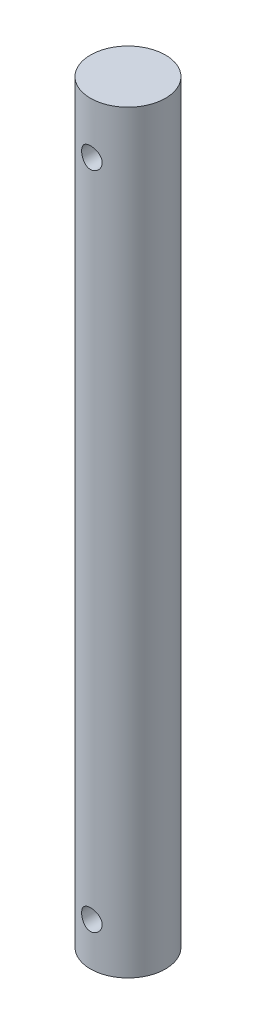
ISO-10303-21;
HEADER;
FILE_DESCRIPTION(('STEP AP214'),'2;1');
FILE_NAME('part.step','',(''),(''),'','','');
FILE_SCHEMA(('AUTOMOTIVE_DESIGN { 1 0 10303 214 1 1 1 1 }'));
ENDSEC;
DATA;
#1=APPLICATION_CONTEXT('core data for automotive mechanical design processes');
#2=APPLICATION_PROTOCOL_DEFINITION('international standard','automotive_design',2000,#1);
#3=PRODUCT_CONTEXT('',#1,'mechanical');
#4=PRODUCT('Part','Part','',(#3));
#5=PRODUCT_RELATED_PRODUCT_CATEGORY('part','',(#4));
#6=PRODUCT_DEFINITION_FORMATION('','',#4);
#7=PRODUCT_DEFINITION_CONTEXT('part definition',#1,'design');
#8=PRODUCT_DEFINITION('design','',#6,#7);
#9=PRODUCT_DEFINITION_SHAPE('','',#8);
#10=(LENGTH_UNIT() NAMED_UNIT(*) SI_UNIT(.MILLI.,.METRE.));
#11=(NAMED_UNIT(*) PLANE_ANGLE_UNIT() SI_UNIT($,.RADIAN.));
#12=(NAMED_UNIT(*) SI_UNIT($,.STERADIAN.) SOLID_ANGLE_UNIT());
#13=UNCERTAINTY_MEASURE_WITH_UNIT(LENGTH_MEASURE(1.E-05),#10,'distance_accuracy_value','');
#14=(GEOMETRIC_REPRESENTATION_CONTEXT(3) GLOBAL_UNCERTAINTY_ASSIGNED_CONTEXT((#13)) GLOBAL_UNIT_ASSIGNED_CONTEXT((#10,
#11,#12)) REPRESENTATION_CONTEXT('',''));
#15=CARTESIAN_POINT('',(0.,0.,0.));
#16=DIRECTION('',(0.,0.,1.));
#17=DIRECTION('',(1.,0.,0.));
#18=AXIS2_PLACEMENT_3D('',#15,#16,#17);
#19=CARTESIAN_POINT('',(0.,111.76,0.));
#20=DIRECTION('',(0.,-1.,0.));
#21=DIRECTION('',(0.,0.,-1.));
#22=AXIS2_PLACEMENT_3D('',#19,#20,#21);
#23=CYLINDRICAL_SURFACE('',#22,5.55625);
#24=CARTESIAN_POINT('',(0.,105.664,-5.55625));
#25=CARTESIAN_POINT('',(-0.0839243274042606,105.663998199307,-5.55624882927294));
#26=CARTESIAN_POINT('',(-0.167867613481108,105.65704443173,-5.55432995065547));
#27=CARTESIAN_POINT('',(-0.333330188617833,105.629465965434,-5.54686174318601));
#28=CARTESIAN_POINT('',(-0.414848392822721,105.608835241665,-5.5413108143368));
#29=CARTESIAN_POINT('',(-0.573048949549514,105.554628448365,-5.52719021743517));
#30=CARTESIAN_POINT('',(-0.649737580305421,105.521069606601,-5.51862456804953));
#31=CARTESIAN_POINT('',(-0.796398529338004,105.44202456858,-5.49937645772791));
#32=CARTESIAN_POINT('',(-0.866370297474205,105.396537396477,-5.48869382362082));
#33=CARTESIAN_POINT('',(-0.99931928369471,105.293755055338,-5.46607048298212));
#34=CARTESIAN_POINT('',(-1.06210920833413,105.236222567386,-5.45410730472241));
#35=CARTESIAN_POINT('',(-1.17728133710283,105.111489691459,-5.43041318256194));
#36=CARTESIAN_POINT('',(-1.22966211746745,105.044287983091,-5.41868227062791));
#37=CARTESIAN_POINT('',(-1.32345791673896,104.900609739913,-5.39654936725636));
#38=CARTESIAN_POINT('',(-1.36465461047249,104.823985922807,-5.38617563863397));
#39=CARTESIAN_POINT('',(-1.43350548692101,104.664568614997,-5.36826327411803));
#40=CARTESIAN_POINT('',(-1.46116232846057,104.581776339277,-5.36072408167333));
#41=CARTESIAN_POINT('',(-1.50149248412255,104.414453214906,-5.34956689273426));
#42=CARTESIAN_POINT('',(-1.51450666910971,104.330010611584,-5.34585986082083));
#43=CARTESIAN_POINT('',(-1.5262452131801,104.160065544931,-5.34252094447796));
#44=CARTESIAN_POINT('',(-1.52497241089828,104.074563295508,-5.3428882505314));
#45=CARTESIAN_POINT('',(-1.50844309109985,103.907610283374,-5.34757698918831));
#46=CARTESIAN_POINT('',(-1.49360213219395,103.826114548185,-5.35178090922778));
#47=CARTESIAN_POINT('',(-1.45102462477444,103.666816673094,-5.36348061470836));
#48=CARTESIAN_POINT('',(-1.42328699250619,103.58901484421,-5.37097667679728));
#49=CARTESIAN_POINT('',(-1.35537214758625,103.438244815396,-5.38851725394586));
#50=CARTESIAN_POINT('',(-1.31505166939105,103.365344678303,-5.39859086555452));
#51=CARTESIAN_POINT('',(-1.22321553044335,103.227200544977,-5.42013622554189));
#52=CARTESIAN_POINT('',(-1.17169755151803,103.161958138406,-5.43160826321474));
#53=CARTESIAN_POINT('',(-1.05681733719701,103.038610809698,-5.45514428743246));
#54=CARTESIAN_POINT('',(-0.993106997980926,102.98083090482,-5.46721502232855));
#55=CARTESIAN_POINT('',(-0.856752537903141,102.876706774006,-5.49023340090312));
#56=CARTESIAN_POINT('',(-0.784108023579616,102.830363051991,-5.50118099507941));
#57=CARTESIAN_POINT('',(-0.631424988575477,102.750272126302,-5.52079353773937));
#58=CARTESIAN_POINT('',(-0.551352559274145,102.716586631162,-5.52944724479469));
#59=CARTESIAN_POINT('',(-0.386388936646239,102.663250461562,-5.54341585122075));
#60=CARTESIAN_POINT('',(-0.301498864363417,102.643596536356,-5.54873152389172));
#61=CARTESIAN_POINT('',(-0.132081052810915,102.619398428831,-5.55530699804715));
#62=CARTESIAN_POINT('',(-0.0476208856908242,102.614412682289,-5.55668529048076));
#63=CARTESIAN_POINT('',(0.120929807927627,102.618469039359,-5.55557289822189));
#64=CARTESIAN_POINT('',(0.205020374006141,102.627509602299,-5.55308263845726));
#65=CARTESIAN_POINT('',(0.368848997837754,102.659000757044,-5.54458974100724));
#66=CARTESIAN_POINT('',(0.448638585108349,102.681202488859,-5.5386523262704));
#67=CARTESIAN_POINT('',(0.603351080798779,102.738094495566,-5.52394113073766));
#68=CARTESIAN_POINT('',(0.678273445806869,102.772786162106,-5.5151670338855));
#69=CARTESIAN_POINT('',(0.822820693886013,102.854475022256,-5.49548122212863));
#70=CARTESIAN_POINT('',(0.892306156232276,102.901709036011,-5.48452951452932));
#71=CARTESIAN_POINT('',(1.02251874875153,103.006846344263,-5.46175304336441));
#72=CARTESIAN_POINT('',(1.08324404065646,103.064751872323,-5.4499280973399));
#73=CARTESIAN_POINT('',(1.19609216047285,103.191653144048,-5.4262976262354));
#74=CARTESIAN_POINT('',(1.24790272921414,103.260929188316,-5.41450329841938));
#75=CARTESIAN_POINT('',(1.33917340547728,103.407443971058,-5.39265605664099));
#76=CARTESIAN_POINT('',(1.37863400084672,103.484682394842,-5.38260307389916));
#77=CARTESIAN_POINT('',(1.44378953392984,103.644565825087,-5.36549357581121));
#78=CARTESIAN_POINT('',(1.46956208430331,103.727177301195,-5.35842021405634));
#79=CARTESIAN_POINT('',(1.50678006719011,103.895790431922,-5.34807518269966));
#80=CARTESIAN_POINT('',(1.5182294227727,103.98179115158,-5.34480247213138));
#81=CARTESIAN_POINT('',(1.52624090954879,104.151534821032,-5.34251977468923));
#82=CARTESIAN_POINT('',(1.52330637763806,104.235252421502,-5.34336565837555));
#83=CARTESIAN_POINT('',(1.50380839065478,104.400950020403,-5.3488853889634));
#84=CARTESIAN_POINT('',(1.48724532571573,104.482930068505,-5.3535591262879));
#85=CARTESIAN_POINT('',(1.44125991905776,104.642150700005,-5.36611966754493));
#86=CARTESIAN_POINT('',(1.41195006317309,104.719426149309,-5.37397832529271));
#87=CARTESIAN_POINT('',(1.34139014616994,104.868022393666,-5.39202250814459));
#88=CARTESIAN_POINT('',(1.30013811478295,104.93934220363,-5.40220841714954));
#89=CARTESIAN_POINT('',(1.2053641066089,105.076390803484,-5.42415369878218));
#90=CARTESIAN_POINT('',(1.15150145907919,105.141877789456,-5.43595205485115));
#91=CARTESIAN_POINT('',(1.03367543481417,105.263047137032,-5.45958180950221));
#92=CARTESIAN_POINT('',(0.969709573359407,105.31872707961,-5.47141321550743));
#93=CARTESIAN_POINT('',(0.831715889749732,105.419966485837,-5.49410203830745));
#94=CARTESIAN_POINT('',(0.757490272137247,105.465263352594,-5.50493075009454));
#95=CARTESIAN_POINT('',(0.602181813240706,105.542665501018,-5.52407410513523));
#96=CARTESIAN_POINT('',(0.521103155250167,105.574778761207,-5.5323902681384));
#97=CARTESIAN_POINT('',(0.367006263526612,105.620994877289,-5.54457111499069));
#98=CARTESIAN_POINT('',(0.294615536455409,105.63708303896,-5.54891787666377));
#99=CARTESIAN_POINT('',(0.14815467190509,105.658585799439,-5.55475767664331));
#100=CARTESIAN_POINT('',(0.0740847228064985,105.664001589573,-5.55625103346661));
#101=CARTESIAN_POINT('',(0.,105.664,-5.55625));
#102=B_SPLINE_CURVE_WITH_KNOTS('',3,(#24,#25,#26,#27,#28,#29,#30,#31,#32,#33,#34,#35,#36,#37,
#38,#39,#40,#41,#42,#43,#44,#45,#46,#47,#48,#49,#50,#51,#52,#53,#54,#55,#56,#57,#58,#59,#60,#61,
#62,#63,#64,#65,#66,#67,#68,#69,#70,#71,#72,#73,#74,#75,#76,#77,#78,#79,#80,#81,#82,#83,#84,#85,
#86,#87,#88,#89,#90,#91,#92,#93,#94,#95,#96,#97,#98,#99,#100,#101),.UNSPECIFIED.,.T.,.F.,(4,2,2,
2,2,2,2,2,2,2,2,2,2,2,2,2,2,2,2,2,2,2,2,2,2,2,2,2,2,2,2,2,2,2,2,2,2,2,4),(0.,0.251501199213716,
0.503113264841162,0.754391190344406,1.00568967908189,1.26250543026143,1.5193562846045,
1.78090970140115,2.04241173625782,2.2976913839688,2.55292031189629,2.80058492434025,
3.04827035271029,3.29888562977404,3.54955284019771,3.80889216152386,4.06824290826825,
4.32884206806183,4.58938083428702,4.8419918929869,5.09457520645361,5.34252836207593,
5.5905091535655,5.84355386965232,6.0966516086208,6.35733261546725,6.61800332361465,
6.8771797807112,7.13628523479639,7.38638986963814,7.63648734517623,7.88442121500447,
8.13239601330179,8.38805664239398,8.64378024520016,8.90539297476192,9.16684714600983,
9.38888618327888,9.61090043356293),.UNSPECIFIED.);
#103=CARTESIAN_POINT('',(0.,105.664,-5.55625));
#104=VERTEX_POINT('',#103);
#105=EDGE_CURVE('E10',#104,#104,#102,.T.);
#106=ORIENTED_EDGE('',*,*,#105,.T.);
#107=EDGE_LOOP('',(#106));
#108=FACE_BOUND('',#107,.T.);
#109=CARTESIAN_POINT('',(1.524,104.14,5.34315806078203));
#110=CARTESIAN_POINT('',(1.52399816833775,104.056142663534,5.34315941810247));
#111=CARTESIAN_POINT('',(1.51705511226946,103.972266312316,5.34515377744604));
#112=CARTESIAN_POINT('',(1.48952304253656,103.806942508978,5.35289015791346));
#113=CARTESIAN_POINT('',(1.46892769632138,103.725496202351,5.35863391816043));
#114=CARTESIAN_POINT('',(1.41482426278523,103.567448251648,5.37317072542769));
#115=CARTESIAN_POINT('',(1.38133504918774,103.490839716064,5.38195931362969));
#116=CARTESIAN_POINT('',(1.30245434054345,103.344314786264,5.40158976640219));
#117=CARTESIAN_POINT('',(1.25706172631206,103.274399022162,5.41243182401788));
#118=CARTESIAN_POINT('',(1.15437813864968,103.141394526199,5.43526909544026));
#119=CARTESIAN_POINT('',(1.09682853873585,103.078509089796,5.44728568862049));
#120=CARTESIAN_POINT('',(0.972020397107993,102.963150435461,5.47093396159151));
#121=CARTESIAN_POINT('',(0.904760800373784,102.910678350444,5.48256559938672));
#122=CARTESIAN_POINT('',(0.761024229955041,102.816780513865,5.50437290503279));
#123=CARTESIAN_POINT('',(0.684409841659558,102.775558005564,5.5145204178342));
#124=CARTESIAN_POINT('',(0.525012541295411,102.70665688816,5.53197014500868));
#125=CARTESIAN_POINT('',(0.442230735174049,102.678975857491,5.53927286805626));
#126=CARTESIAN_POINT('',(0.274971592318378,102.638604649509,5.55005900415462));
#127=CARTESIAN_POINT('',(0.19058356734784,102.625568384738,5.55363044585493));
#128=CARTESIAN_POINT('',(0.0207477400907249,102.613766707802,5.55685988222459));
#129=CARTESIAN_POINT('',(-0.064699872273332,102.614998774057,5.55651856837839));
#130=CARTESIAN_POINT('',(-0.231816279019823,102.631457559312,5.55202495351416));
#131=CARTESIAN_POINT('',(-0.313525077460526,102.646310181193,5.5479745297692));
#132=CARTESIAN_POINT('',(-0.473242734899581,102.68898263309,5.53663879955745));
#133=CARTESIAN_POINT('',(-0.551251376716399,102.716803223228,5.52935330346678));
#134=CARTESIAN_POINT('',(-0.702294851027764,102.784901146699,5.51221718419817));
#135=CARTESIAN_POINT('',(-0.775269906878719,102.825304321132,5.5023408139316));
#136=CARTESIAN_POINT('',(-0.91353013480948,102.917323333223,5.48108354612888));
#137=CARTESIAN_POINT('',(-0.978813729397899,102.968941464876,5.46970234096875));
#138=CARTESIAN_POINT('',(-1.10207116119661,103.083901327657,5.44622999085762));
#139=CARTESIAN_POINT('',(-1.15973930813281,103.147568950491,5.4341277921692));
#140=CARTESIAN_POINT('',(-1.26365720776398,103.283795518428,5.41090819574316));
#141=CARTESIAN_POINT('',(-1.30990617823429,103.356355072127,5.39979086550342));
#142=CARTESIAN_POINT('',(-1.38992383136705,103.508999307096,5.3797533900604));
#143=CARTESIAN_POINT('',(-1.42360483707505,103.589132139214,5.37084882024921));
#144=CARTESIAN_POINT('',(-1.47691439394927,103.754229086825,5.35643622584647));
#145=CARTESIAN_POINT('',(-1.49654666394411,103.839191917341,5.35092730244986));
#146=CARTESIAN_POINT('',(-1.52066487732922,104.008666937251,5.34412252677493));
#147=CARTESIAN_POINT('',(-1.52560873389226,104.093108917344,5.34269935004931));
#148=CARTESIAN_POINT('',(-1.52147519923593,104.261613936199,5.34387801574711));
#149=CARTESIAN_POINT('',(-1.51239939934314,104.345677016882,5.34647940135533));
#150=CARTESIAN_POINT('',(-1.48088883607338,104.509242481336,5.35529064753445));
#151=CARTESIAN_POINT('',(-1.45873355718454,104.588803177399,5.36142495097166));
#152=CARTESIAN_POINT('',(-1.40200931185635,104.743078107674,5.37653605167272));
#153=CARTESIAN_POINT('',(-1.36743865594816,104.817791680662,5.3855132357725));
#154=CARTESIAN_POINT('',(-1.28594890708856,104.962155664807,5.40555674374057));
#155=CARTESIAN_POINT('',(-1.23876324244313,105.031649431092,5.41666650060783));
#156=CARTESIAN_POINT('',(-1.13371024147767,105.161900560189,5.43962318863844));
#157=CARTESIAN_POINT('',(-1.07584077660519,105.222656177786,5.4514702663872));
#158=CARTESIAN_POINT('',(-0.94893709602466,105.335629378083,5.4750083131647));
#159=CARTESIAN_POINT('',(-0.879613955130439,105.387526437876,5.48668324147607));
#160=CARTESIAN_POINT('',(-0.732976059744222,105.47894943561,5.50818873122632));
#161=CARTESIAN_POINT('',(-0.655661730321704,105.518476031115,5.51801939068783));
#162=CARTESIAN_POINT('',(-0.495779467362986,105.583666353693,5.5346653466112));
#163=CARTESIAN_POINT('',(-0.413256599149013,105.609434540148,5.54150329121973));
#164=CARTESIAN_POINT('',(-0.244835095855061,105.646673543044,5.55149321901716));
#165=CARTESIAN_POINT('',(-0.158937260620097,105.658147726238,5.55464607016752));
#166=CARTESIAN_POINT('',(0.0108088965678619,105.666251999092,5.5568669589549));
#167=CARTESIAN_POINT('',(0.0946334508767148,105.663350991294,5.55606403455116));
#168=CARTESIAN_POINT('',(0.26055415651223,105.643883020738,5.55075810383556));
#169=CARTESIAN_POINT('',(0.342650379415667,105.627316625061,5.54625525106217));
#170=CARTESIAN_POINT('',(0.502185417404082,105.58125928302,5.53408359766452));
#171=CARTESIAN_POINT('',(0.579655097689046,105.551868335959,5.52643931859486));
#172=CARTESIAN_POINT('',(0.72860741827618,105.481085203441,5.50878181387809));
#173=CARTESIAN_POINT('',(0.800089180653257,105.439691262107,5.49876824167477));
#174=CARTESIAN_POINT('',(0.937199610397853,105.344732208982,5.47709107884905));
#175=CARTESIAN_POINT('',(1.00260936098065,105.290859769732,5.46538925033646));
#176=CARTESIAN_POINT('',(1.1236185633773,105.173049297683,5.44180154601972));
#177=CARTESIAN_POINT('',(1.17921537880202,105.109108568595,5.42991562168566));
#178=CARTESIAN_POINT('',(1.2803264223329,104.971158656882,5.40698025075123));
#179=CARTESIAN_POINT('',(1.32557120376756,104.896947175936,5.39595722357438));
#180=CARTESIAN_POINT('',(1.40287948777494,104.741677435336,5.37637832131599));
#181=CARTESIAN_POINT('',(1.43495113271359,104.660623442533,5.36782092319924));
#182=CARTESIAN_POINT('',(1.48108479794873,104.50662526525,5.35525731925474));
#183=CARTESIAN_POINT('',(1.49713885498615,104.434312211491,5.35075809136449));
#184=CARTESIAN_POINT('',(1.51859657222325,104.288004228918,5.34470805475607));
#185=CARTESIAN_POINT('',(1.52400161656033,104.214009519948,5.34315686285901));
#186=CARTESIAN_POINT('',(1.524,104.14,5.34315806078203));
#187=B_SPLINE_CURVE_WITH_KNOTS('',3,(#109,#110,#111,#112,#113,#114,#115,#116,#117,#118,#119,
#120,#121,#122,#123,#124,#125,#126,#127,#128,#129,#130,#131,#132,#133,#134,#135,#136,#137,#138,
#139,#140,#141,#142,#143,#144,#145,#146,#147,#148,#149,#150,#151,#152,#153,#154,#155,#156,#157,
#158,#159,#160,#161,#162,#163,#164,#165,#166,#167,#168,#169,#170,#171,#172,#173,#174,#175,#176,
#177,#178,#179,#180,#181,#182,#183,#184,#185,#186),.UNSPECIFIED.,.T.,.F.,(4,2,2,2,2,2,2,2,2,2,2,
2,2,2,2,2,2,2,2,2,2,2,2,2,2,2,2,2,2,2,2,2,2,2,2,2,2,2,4),(0.,0.251299684012806,
0.502716013842926,0.753765717303962,1.00483903349335,1.26191776165384,1.51902444323862,
1.7805077724089,2.04194432447611,2.29706330537927,2.55213720089796,2.8004085772176,
3.04869450789521,3.2995479832589,3.55045281854452,3.80949397091681,4.06855286293905,
4.329386641543,4.59015134949736,4.842696644693,5.0952132763824,5.3425200038236,5.58986039721173,
5.84290906380244,6.09600820024035,6.35690106341935,6.61778005624893,6.87664912293623,
7.13545720509662,7.38587992283979,7.63629224914312,7.88478593814152,8.13331599677645,
8.38877937017707,8.64431127343673,8.90588443434423,9.16729567169272,9.38911272001935,
9.61090093510663),.UNSPECIFIED.);
#188=CARTESIAN_POINT('',(1.524,104.14,5.34315806078203));
#189=VERTEX_POINT('',#188);
#190=EDGE_CURVE('E41',#189,#189,#187,.T.);
#191=ORIENTED_EDGE('',*,*,#190,.T.);
#192=EDGE_LOOP('',(#191));
#193=FACE_BOUND('',#192,.T.);
#194=CARTESIAN_POINT('',(0.,7.87399999999999,-5.55625));
#195=CARTESIAN_POINT('',(-0.0839243274042608,7.87399819930739,-5.55624882927294));
#196=CARTESIAN_POINT('',(-0.167867613481108,7.86704443172989,-5.55432995065547));
#197=CARTESIAN_POINT('',(-0.333330188617833,7.83946596543379,-5.54686174318601));
#198=CARTESIAN_POINT('',(-0.414848392822721,7.81883524166532,-5.5413108143368));
#199=CARTESIAN_POINT('',(-0.573048949549514,7.76462844836516,-5.52719021743517));
#200=CARTESIAN_POINT('',(-0.649737580305422,7.73106960660053,-5.51862456804953));
#201=CARTESIAN_POINT('',(-0.796398529338005,7.6520245685796,-5.49937645772791));
#202=CARTESIAN_POINT('',(-0.866370297474207,7.60653739647749,-5.48869382362082));
#203=CARTESIAN_POINT('',(-0.999319283694711,7.50375505533822,-5.46607048298212));
#204=CARTESIAN_POINT('',(-1.06210920833413,7.44622256738624,-5.45410730472241));
#205=CARTESIAN_POINT('',(-1.17728133710283,7.32148969145912,-5.43041318256194));
#206=CARTESIAN_POINT('',(-1.22966211746745,7.25428798309057,-5.41868227062791));
#207=CARTESIAN_POINT('',(-1.32345791673896,7.11060973991275,-5.39654936725636));
#208=CARTESIAN_POINT('',(-1.3646546104725,7.03398592280721,-5.38617563863397));
#209=CARTESIAN_POINT('',(-1.43350548692102,6.8745686149973,-5.36826327411803));
#210=CARTESIAN_POINT('',(-1.46116232846058,6.791776339277,-5.36072408167333));
#211=CARTESIAN_POINT('',(-1.50149248412255,6.6244532149059,-5.34956689273426));
#212=CARTESIAN_POINT('',(-1.51450666910971,6.54001061158443,-5.34585986082083));
#213=CARTESIAN_POINT('',(-1.5262452131801,6.37006554493076,-5.34252094447796));
#214=CARTESIAN_POINT('',(-1.52497241089827,6.28456329550833,-5.3428882505314));
#215=CARTESIAN_POINT('',(-1.50844309109985,6.11761028337449,-5.34757698918831));
#216=CARTESIAN_POINT('',(-1.49360213219394,6.03611454818482,-5.35178090922778));
#217=CARTESIAN_POINT('',(-1.45102462477444,5.87681667309361,-5.36348061470836));
#218=CARTESIAN_POINT('',(-1.42328699250619,5.79901484421022,-5.37097667679728));
#219=CARTESIAN_POINT('',(-1.35537214758625,5.64824481539637,-5.38851725394586));
#220=CARTESIAN_POINT('',(-1.31505166939104,5.5753446783032,-5.39859086555452));
#221=CARTESIAN_POINT('',(-1.22321553044334,5.43720054497681,-5.42013622554189));
#222=CARTESIAN_POINT('',(-1.17169755151802,5.37195813840589,-5.43160826321474));
#223=CARTESIAN_POINT('',(-1.05681733719701,5.24861080969822,-5.45514428743246));
#224=CARTESIAN_POINT('',(-0.993106997980925,5.19083090482009,-5.46721502232855));
#225=CARTESIAN_POINT('',(-0.85675253790314,5.08670677400615,-5.49023340090312));
#226=CARTESIAN_POINT('',(-0.784108023579616,5.0403630519912,-5.50118099507941));
#227=CARTESIAN_POINT('',(-0.631424988575478,4.96027212630196,-5.52079353773937));
#228=CARTESIAN_POINT('',(-0.551352559274146,4.9265866311623,-5.52944724479469));
#229=CARTESIAN_POINT('',(-0.386388936646241,4.87325046156165,-5.54341585122075));
#230=CARTESIAN_POINT('',(-0.30149886436342,4.85359653635557,-5.54873152389172));
#231=CARTESIAN_POINT('',(-0.132081052810918,4.82939842883106,-5.55530699804715));
#232=CARTESIAN_POINT('',(-0.0476208856908259,4.82441268228894,-5.55668529048076));
#233=CARTESIAN_POINT('',(0.120929807927628,4.82846903935902,-5.55557289822189));
#234=CARTESIAN_POINT('',(0.205020374006142,4.83750960229926,-5.55308263845726));
#235=CARTESIAN_POINT('',(0.368848997837756,4.86900075704409,-5.54458974100724));
#236=CARTESIAN_POINT('',(0.448638585108351,4.89120248885913,-5.5386523262704));
#237=CARTESIAN_POINT('',(0.603351080798781,4.94809449556632,-5.52394113073766));
#238=CARTESIAN_POINT('',(0.67827344580687,4.98278616210574,-5.5151670338855));
#239=CARTESIAN_POINT('',(0.822820693886008,5.06447502225642,-5.49548122212863));
#240=CARTESIAN_POINT('',(0.892306156232265,5.11170903601079,-5.48452951452932));
#241=CARTESIAN_POINT('',(1.02251874875152,5.21684634426268,-5.46175304336441));
#242=CARTESIAN_POINT('',(1.08324404065646,5.27475187232282,-5.44992809733991));
#243=CARTESIAN_POINT('',(1.19609216047285,5.40165314404778,-5.4262976262354));
#244=CARTESIAN_POINT('',(1.24790272921415,5.47092918831593,-5.41450329841938));
#245=CARTESIAN_POINT('',(1.33917340547728,5.61744397105765,-5.39265605664099));
#246=CARTESIAN_POINT('',(1.37863400084672,5.6946823948417,-5.38260307389916));
#247=CARTESIAN_POINT('',(1.44378953392984,5.85456582508708,-5.36549357581121));
#248=CARTESIAN_POINT('',(1.46956208430331,5.93717730119525,-5.35842021405634));
#249=CARTESIAN_POINT('',(1.50678006719011,6.10579043192213,-5.34807518269966));
#250=CARTESIAN_POINT('',(1.5182294227727,6.19179115158008,-5.34480247213137));
#251=CARTESIAN_POINT('',(1.52624090954879,6.36153482103156,-5.34251977468924));
#252=CARTESIAN_POINT('',(1.52330637763806,6.44525242150227,-5.34336565837555));
#253=CARTESIAN_POINT('',(1.50380839065478,6.61095002040344,-5.3488853889634));
#254=CARTESIAN_POINT('',(1.48724532571573,6.69293006850456,-5.3535591262879));
#255=CARTESIAN_POINT('',(1.44125991905776,6.85215070000544,-5.36611966754493));
#256=CARTESIAN_POINT('',(1.41195006317309,6.92942614930916,-5.37397832529271));
#257=CARTESIAN_POINT('',(1.34139014616993,7.07802239366595,-5.39202250814459));
#258=CARTESIAN_POINT('',(1.30013811478295,7.14934220362979,-5.40220841714954));
#259=CARTESIAN_POINT('',(1.20536410660889,7.28639080348406,-5.42415369878218));
#260=CARTESIAN_POINT('',(1.15150145907919,7.35187778945602,-5.43595205485115));
#261=CARTESIAN_POINT('',(1.03367543481418,7.47304713703164,-5.45958180950221));
#262=CARTESIAN_POINT('',(0.969709573359412,7.52872707961045,-5.47141321550743));
#263=CARTESIAN_POINT('',(0.831715889749735,7.6299664858372,-5.49410203830745));
#264=CARTESIAN_POINT('',(0.75749027213725,7.67526335259389,-5.50493075009454));
#265=CARTESIAN_POINT('',(0.602181813240709,7.7526655010184,-5.52407410513522));
#266=CARTESIAN_POINT('',(0.52110315525017,7.78477876120663,-5.5323902681384));
#267=CARTESIAN_POINT('',(0.367006263526615,7.83099487728939,-5.54457111499069));
#268=CARTESIAN_POINT('',(0.294615536455411,7.84708303896018,-5.54891787666377));
#269=CARTESIAN_POINT('',(0.148154671905092,7.86858579943868,-5.55475767664331));
#270=CARTESIAN_POINT('',(0.0740847228064993,7.8740015895726,-5.55625103346661));
#271=CARTESIAN_POINT('',(0.,7.87399999999999,-5.55625));
#272=B_SPLINE_CURVE_WITH_KNOTS('',3,(#194,#195,#196,#197,#198,#199,#200,#201,#202,#203,#204,
#205,#206,#207,#208,#209,#210,#211,#212,#213,#214,#215,#216,#217,#218,#219,#220,#221,#222,#223,
#224,#225,#226,#227,#228,#229,#230,#231,#232,#233,#234,#235,#236,#237,#238,#239,#240,#241,#242,
#243,#244,#245,#246,#247,#248,#249,#250,#251,#252,#253,#254,#255,#256,#257,#258,#259,#260,#261,
#262,#263,#264,#265,#266,#267,#268,#269,#270,#271),.UNSPECIFIED.,.T.,.F.,(4,2,2,2,2,2,2,2,2,2,2,
2,2,2,2,2,2,2,2,2,2,2,2,2,2,2,2,2,2,2,2,2,2,2,2,2,2,2,4),(0.,0.251501199213716,
0.503113264841162,0.754391190344409,1.00568967908189,1.26250543026143,1.5193562846045,
1.78090970140115,2.04241173625783,2.29769138396881,2.55292031189629,2.80058492434026,
3.04827035271031,3.29888562977405,3.54955284019772,3.80889216152386,4.06824290826825,
4.32884206806182,4.58938083428701,4.84199189298689,5.09457520645361,5.34252836207593,
5.5905091535655,5.8435538696523,6.0966516086208,6.35733261546725,6.61800332361465,
6.8771797807112,7.1362852347964,7.38638986963814,7.63648734517624,7.88442121500447,
8.13239601330179,8.38805664239396,8.64378024520015,8.90539297476191,9.16684714600983,
9.38888618327887,9.61090043356292),.UNSPECIFIED.);
#273=CARTESIAN_POINT('',(0.,7.87399999999999,-5.55625));
#274=VERTEX_POINT('',#273);
#275=EDGE_CURVE('E45',#274,#274,#272,.T.);
#276=ORIENTED_EDGE('',*,*,#275,.T.);
#277=EDGE_LOOP('',(#276));
#278=FACE_BOUND('',#277,.T.);
#279=CARTESIAN_POINT('',(1.524,6.35,5.34315806078203));
#280=CARTESIAN_POINT('',(1.52399816833775,6.26614266353408,5.34315941810247));
#281=CARTESIAN_POINT('',(1.51705511226946,6.18226631231632,5.34515377744604));
#282=CARTESIAN_POINT('',(1.48952304253656,6.01694250897791,5.35289015791346));
#283=CARTESIAN_POINT('',(1.46892769632138,5.93549620235125,5.35863391816043));
#284=CARTESIAN_POINT('',(1.41482426278522,5.77744825164751,5.37317072542769));
#285=CARTESIAN_POINT('',(1.38133504918774,5.70083971606363,5.38195931362969));
#286=CARTESIAN_POINT('',(1.30245434054345,5.55431478626414,5.40158976640219));
#287=CARTESIAN_POINT('',(1.25706172631205,5.48439902216223,5.41243182401789));
#288=CARTESIAN_POINT('',(1.15437813864967,5.3513945261991,5.43526909544026));
#289=CARTESIAN_POINT('',(1.09682853873584,5.28850908979578,5.44728568862049));
#290=CARTESIAN_POINT('',(0.972020397107981,5.17315043546106,5.47093396159151));
#291=CARTESIAN_POINT('',(0.904760800373778,5.12067835044448,5.48256559938672));
#292=CARTESIAN_POINT('',(0.761024229955038,5.02678051386481,5.50437290503279));
#293=CARTESIAN_POINT('',(0.684409841659555,4.98555800556382,5.5145204178342));
#294=CARTESIAN_POINT('',(0.525012541295408,4.91665688816035,5.53197014500868));
#295=CARTESIAN_POINT('',(0.442230735174047,4.8889758574908,5.53927286805626));
#296=CARTESIAN_POINT('',(0.274971592318377,4.84860464950891,5.55005900415462));
#297=CARTESIAN_POINT('',(0.190583567347837,4.83556838473792,5.55363044585493));
#298=CARTESIAN_POINT('',(0.0207477400907217,4.82376670780229,5.55685988222459));
#299=CARTESIAN_POINT('',(-0.0646998722733353,4.82499877405731,5.55651856837839));
#300=CARTESIAN_POINT('',(-0.231816279019827,4.84145755931228,5.55202495351416));
#301=CARTESIAN_POINT('',(-0.31352507746053,4.85631018119319,5.5479745297692));
#302=CARTESIAN_POINT('',(-0.473242734899586,4.89898263308985,5.53663879955745));
#303=CARTESIAN_POINT('',(-0.551251376716403,4.92680322322833,5.52935330346678));
#304=CARTESIAN_POINT('',(-0.702294851027769,4.99490114669857,5.51221718419817));
#305=CARTESIAN_POINT('',(-0.775269906878726,5.03530432113242,5.5023408139316));
#306=CARTESIAN_POINT('',(-0.913530134809488,5.12732333322339,5.48108354612888));
#307=CARTESIAN_POINT('',(-0.978813729397905,5.17894146487562,5.46970234096875));
#308=CARTESIAN_POINT('',(-1.10207116119661,5.29390132765668,5.44622999085762));
#309=CARTESIAN_POINT('',(-1.15973930813282,5.3575689504914,5.4341277921692));
#310=CARTESIAN_POINT('',(-1.26365720776398,5.49379551842797,5.41090819574316));
#311=CARTESIAN_POINT('',(-1.30990617823429,5.56635507212654,5.39979086550342));
#312=CARTESIAN_POINT('',(-1.38992383136705,5.71899930709583,5.3797533900604));
#313=CARTESIAN_POINT('',(-1.42360483707505,5.79913213921413,5.37084882024921));
#314=CARTESIAN_POINT('',(-1.47691439394926,5.96422908682545,5.35643622584647));
#315=CARTESIAN_POINT('',(-1.49654666394411,6.04919191734093,5.35092730244986));
#316=CARTESIAN_POINT('',(-1.52066487732922,6.21866693725069,5.34412252677493));
#317=CARTESIAN_POINT('',(-1.52560873389226,6.30310891734379,5.34269935004931));
#318=CARTESIAN_POINT('',(-1.52147519923593,6.47161393619894,5.34387801574711));
#319=CARTESIAN_POINT('',(-1.51239939934314,6.55567701688246,5.34647940135533));
#320=CARTESIAN_POINT('',(-1.48088883607337,6.71924248133576,5.35529064753445));
#321=CARTESIAN_POINT('',(-1.45873355718454,6.79880317739878,5.36142495097166));
#322=CARTESIAN_POINT('',(-1.40200931185635,6.95307810767427,5.37653605167271));
#323=CARTESIAN_POINT('',(-1.36743865594816,7.02779168066191,5.3855132357725));
#324=CARTESIAN_POINT('',(-1.28594890708856,7.17215566480707,5.40555674374057));
#325=CARTESIAN_POINT('',(-1.23876324244313,7.24164943109177,5.41666650060783));
#326=CARTESIAN_POINT('',(-1.13371024147767,7.37190056018881,5.43962318863844));
#327=CARTESIAN_POINT('',(-1.07584077660519,7.43265617778556,5.45147026638721));
#328=CARTESIAN_POINT('',(-0.948937096024653,7.54562937808279,5.4750083131647));
#329=CARTESIAN_POINT('',(-0.87961395513043,7.5975264378756,5.48668324147607));
#330=CARTESIAN_POINT('',(-0.732976059744214,7.68894943561011,5.50818873122632));
#331=CARTESIAN_POINT('',(-0.6556617303217,7.72847603111488,5.51801939068783));
#332=CARTESIAN_POINT('',(-0.495779467362986,7.79366635369281,5.5346653466112));
#333=CARTESIAN_POINT('',(-0.413256599149013,7.81943454014815,5.54150329121973));
#334=CARTESIAN_POINT('',(-0.24483509585506,7.8566735430444,5.55149321901716));
#335=CARTESIAN_POINT('',(-0.158937260620094,7.86814772623808,5.55464607016752));
#336=CARTESIAN_POINT('',(0.0108088965678674,7.87625199909235,5.5568669589549));
#337=CARTESIAN_POINT('',(0.0946334508767202,7.87335099129444,5.55606403455116));
#338=CARTESIAN_POINT('',(0.260554156512235,7.85388302073784,5.55075810383556));
#339=CARTESIAN_POINT('',(0.342650379415673,7.83731662506109,5.54625525106217));
#340=CARTESIAN_POINT('',(0.502185417404088,7.7912592830199,5.53408359766452));
#341=CARTESIAN_POINT('',(0.57965509768905,7.7618683359591,5.52643931859486));
#342=CARTESIAN_POINT('',(0.728607418276182,7.69108520344114,5.50878181387809));
#343=CARTESIAN_POINT('',(0.80008918065326,7.64969126210747,5.49876824167477));
#344=CARTESIAN_POINT('',(0.937199610397861,7.55473220898231,5.47709107884905));
#345=CARTESIAN_POINT('',(1.00260936098067,7.50085976973163,5.46538925033646));
#346=CARTESIAN_POINT('',(1.12361856337731,7.38304929768302,5.44180154601971));
#347=CARTESIAN_POINT('',(1.17921537880203,7.3191085685951,5.42991562168566));
#348=CARTESIAN_POINT('',(1.28032642233291,7.18115865688161,5.40698025075123));
#349=CARTESIAN_POINT('',(1.32557120376757,7.10694717593605,5.39595722357438));
#350=CARTESIAN_POINT('',(1.40287948777494,6.95167743533646,5.37637832131599));
#351=CARTESIAN_POINT('',(1.43495113271359,6.87062344253263,5.36782092319924));
#352=CARTESIAN_POINT('',(1.48108479794873,6.71662526524963,5.35525731925474));
#353=CARTESIAN_POINT('',(1.49713885498615,6.64431221149058,5.35075809136449));
#354=CARTESIAN_POINT('',(1.51859657222325,6.49800422891801,5.34470805475607));
#355=CARTESIAN_POINT('',(1.52400161656033,6.42400951994752,5.34315686285901));
#356=CARTESIAN_POINT('',(1.524,6.35,5.34315806078203));
#357=B_SPLINE_CURVE_WITH_KNOTS('',3,(#279,#280,#281,#282,#283,#284,#285,#286,#287,#288,#289,
#290,#291,#292,#293,#294,#295,#296,#297,#298,#299,#300,#301,#302,#303,#304,#305,#306,#307,#308,
#309,#310,#311,#312,#313,#314,#315,#316,#317,#318,#319,#320,#321,#322,#323,#324,#325,#326,#327,
#328,#329,#330,#331,#332,#333,#334,#335,#336,#337,#338,#339,#340,#341,#342,#343,#344,#345,#346,
#347,#348,#349,#350,#351,#352,#353,#354,#355,#356),.UNSPECIFIED.,.T.,.F.,(4,2,2,2,2,2,2,2,2,2,2,
2,2,2,2,2,2,2,2,2,2,2,2,2,2,2,2,2,2,2,2,2,2,2,2,2,2,2,4),(0.,0.251299684012812,
0.502716013842932,0.753765717303967,1.00483903349336,1.26191776165385,1.51902444323862,
1.7805077724089,2.04194432447611,2.29706330537927,2.55213720089796,2.8004085772176,
3.04869450789521,3.2995479832589,3.55045281854453,3.80949397091682,4.06855286293905,
4.32938664154298,4.59015134949737,4.842696644693,5.09521327638241,5.3425200038236,
5.58986039721173,5.84290906380244,6.09600820024036,6.35690106341936,6.61778005624894,
6.87664912293623,7.13545720509662,7.3858799228398,7.63629224914312,7.88478593814152,
8.13331599677645,8.38877937017708,8.64431127343674,8.90588443434424,9.16729567169273,
9.38911272001934,9.61090093510663),.UNSPECIFIED.);
#358=CARTESIAN_POINT('',(1.524,6.35,5.34315806078203));
#359=VERTEX_POINT('',#358);
#360=EDGE_CURVE('E49',#359,#359,#357,.T.);
#361=ORIENTED_EDGE('',*,*,#360,.T.);
#362=EDGE_LOOP('',(#361));
#363=FACE_BOUND('',#362,.T.);
#364=CARTESIAN_POINT('',(0.,111.76,0.));
#365=DIRECTION('',(0.,1.,0.));
#366=DIRECTION('',(0.,0.,1.));
#367=AXIS2_PLACEMENT_3D('',#364,#365,#366);
#368=CIRCLE('',#367,5.55625);
#369=CARTESIAN_POINT('',(0.,111.76,5.55625));
#370=VERTEX_POINT('',#369);
#371=EDGE_CURVE('E74',#370,#370,#368,.T.);
#372=ORIENTED_EDGE('',*,*,#371,.F.);
#373=EDGE_LOOP('',(#372));
#374=FACE_BOUND('',#373,.T.);
#375=CARTESIAN_POINT('',(0.,0.,0.));
#376=DIRECTION('',(0.,1.,0.));
#377=DIRECTION('',(0.,0.,1.));
#378=AXIS2_PLACEMENT_3D('',#375,#376,#377);
#379=CIRCLE('',#378,5.55625);
#380=CARTESIAN_POINT('',(0.,0.,5.55625));
#381=VERTEX_POINT('',#380);
#382=EDGE_CURVE('E75',#381,#381,#379,.T.);
#383=ORIENTED_EDGE('',*,*,#382,.T.);
#384=EDGE_LOOP('',(#383));
#385=FACE_BOUND('',#384,.T.);
#386=ADVANCED_FACE('F31',(#108,#193,#278,#363,#374,#385),#23,.T.);
#387=CARTESIAN_POINT('',(0.,111.76,0.));
#388=DIRECTION('',(0.,1.,0.));
#389=DIRECTION('',(0.,0.,1.));
#390=AXIS2_PLACEMENT_3D('',#387,#388,#389);
#391=PLANE('',#390);
#392=ORIENTED_EDGE('',*,*,#371,.T.);
#393=EDGE_LOOP('',(#392));
#394=FACE_BOUND('',#393,.T.);
#395=ADVANCED_FACE('F68',(#394),#391,.T.);
#396=CARTESIAN_POINT('',(0.,0.,0.));
#397=DIRECTION('',(0.,1.,0.));
#398=DIRECTION('',(0.,0.,1.));
#399=AXIS2_PLACEMENT_3D('',#396,#397,#398);
#400=PLANE('',#399);
#401=ORIENTED_EDGE('',*,*,#382,.F.);
#402=EDGE_LOOP('',(#401));
#403=FACE_BOUND('',#402,.T.);
#404=ADVANCED_FACE('F66',(#403),#400,.F.);
#405=CARTESIAN_POINT('',(0.,6.35,5.55625));
#406=DIRECTION('',(0.,0.,1.));
#407=DIRECTION('',(1.,0.,0.));
#408=AXIS2_PLACEMENT_3D('',#405,#406,#407);
#409=CYLINDRICAL_SURFACE('',#408,1.524);
#410=ORIENTED_EDGE('',*,*,#360,.F.);
#411=EDGE_LOOP('',(#410));
#412=FACE_BOUND('',#411,.T.);
#413=ORIENTED_EDGE('',*,*,#275,.F.);
#414=EDGE_LOOP('',(#413));
#415=FACE_BOUND('',#414,.T.);
#416=ADVANCED_FACE('F60',(#412,#415),#409,.F.);
#417=CARTESIAN_POINT('',(0.,104.14,5.55625));
#418=DIRECTION('',(0.,0.,1.));
#419=DIRECTION('',(1.,0.,0.));
#420=AXIS2_PLACEMENT_3D('',#417,#418,#419);
#421=CYLINDRICAL_SURFACE('',#420,1.524);
#422=ORIENTED_EDGE('',*,*,#190,.F.);
#423=EDGE_LOOP('',(#422));
#424=FACE_BOUND('',#423,.T.);
#425=ORIENTED_EDGE('',*,*,#105,.F.);
#426=EDGE_LOOP('',(#425));
#427=FACE_BOUND('',#426,.T.);
#428=ADVANCED_FACE('F57',(#424,#427),#421,.F.);
#429=CLOSED_SHELL('',(#386,#395,#404,#416,#428));
#430=MANIFOLD_SOLID_BREP('B2',#429);
#431=ADVANCED_BREP_SHAPE_REPRESENTATION('',(#18,#430),#14);
#432=SHAPE_DEFINITION_REPRESENTATION(#9,#431);
ENDSEC;
END-ISO-10303-21;
